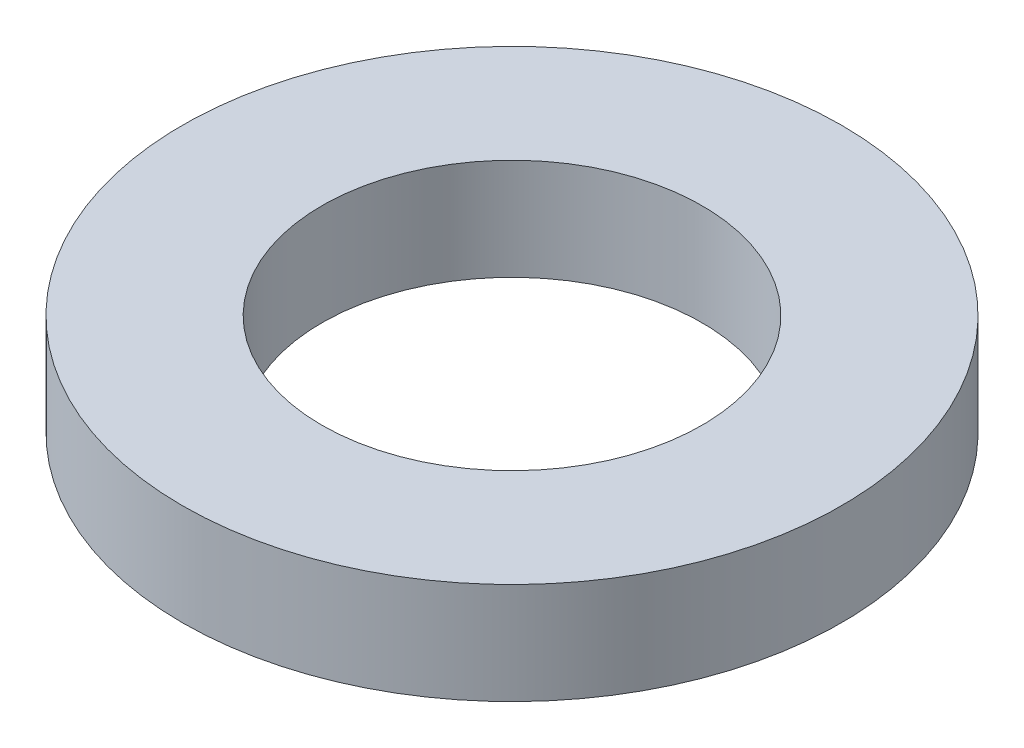
ISO-10303-21;
HEADER;
FILE_DESCRIPTION(('STEP AP214'),'2;1');
FILE_NAME('part.step','',(''),(''),'','','');
FILE_SCHEMA(('AUTOMOTIVE_DESIGN { 1 0 10303 214 1 1 1 1 }'));
ENDSEC;
DATA;
#1=APPLICATION_CONTEXT('core data for automotive mechanical design processes');
#2=APPLICATION_PROTOCOL_DEFINITION('international standard','automotive_design',2000,#1);
#3=PRODUCT_CONTEXT('',#1,'mechanical');
#4=PRODUCT('Part','Part','',(#3));
#5=PRODUCT_RELATED_PRODUCT_CATEGORY('part','',(#4));
#6=PRODUCT_DEFINITION_FORMATION('','',#4);
#7=PRODUCT_DEFINITION_CONTEXT('part definition',#1,'design');
#8=PRODUCT_DEFINITION('design','',#6,#7);
#9=PRODUCT_DEFINITION_SHAPE('','',#8);
#10=(LENGTH_UNIT() NAMED_UNIT(*) SI_UNIT(.MILLI.,.METRE.));
#11=(NAMED_UNIT(*) PLANE_ANGLE_UNIT() SI_UNIT($,.RADIAN.));
#12=(NAMED_UNIT(*) SI_UNIT($,.STERADIAN.) SOLID_ANGLE_UNIT());
#13=UNCERTAINTY_MEASURE_WITH_UNIT(LENGTH_MEASURE(1.E-05),#10,'distance_accuracy_value','');
#14=(GEOMETRIC_REPRESENTATION_CONTEXT(3) GLOBAL_UNCERTAINTY_ASSIGNED_CONTEXT((#13)) GLOBAL_UNIT_ASSIGNED_CONTEXT((#10,
#11,#12)) REPRESENTATION_CONTEXT('',''));
#15=CARTESIAN_POINT('',(0.,0.,0.));
#16=DIRECTION('',(0.,0.,1.));
#17=DIRECTION('',(1.,0.,0.));
#18=AXIS2_PLACEMENT_3D('',#15,#16,#17);
#19=CARTESIAN_POINT('',(0.,20.,0.));
#20=DIRECTION('',(0.,-1.,0.));
#21=DIRECTION('',(0.,0.,-1.));
#22=AXIS2_PLACEMENT_3D('',#19,#20,#21);
#23=CYLINDRICAL_SURFACE('',#22,65.);
#24=CARTESIAN_POINT('',(0.,20.,0.));
#25=DIRECTION('',(0.,1.,0.));
#26=DIRECTION('',(0.,0.,1.));
#27=AXIS2_PLACEMENT_3D('',#24,#25,#26);
#28=CIRCLE('',#27,65.);
#29=CARTESIAN_POINT('',(0.,20.,65.));
#30=VERTEX_POINT('',#29);
#31=EDGE_CURVE('E10',#30,#30,#28,.T.);
#32=ORIENTED_EDGE('',*,*,#31,.F.);
#33=EDGE_LOOP('',(#32));
#34=FACE_BOUND('',#33,.T.);
#35=CARTESIAN_POINT('',(0.,0.,0.));
#36=DIRECTION('',(0.,1.,0.));
#37=DIRECTION('',(0.,0.,1.));
#38=AXIS2_PLACEMENT_3D('',#35,#36,#37);
#39=CIRCLE('',#38,65.);
#40=CARTESIAN_POINT('',(0.,0.,65.));
#41=VERTEX_POINT('',#40);
#42=EDGE_CURVE('E37',#41,#41,#39,.T.);
#43=ORIENTED_EDGE('',*,*,#42,.T.);
#44=EDGE_LOOP('',(#43));
#45=FACE_BOUND('',#44,.T.);
#46=ADVANCED_FACE('F40',(#34,#45),#23,.T.);
#47=CARTESIAN_POINT('',(0.,20.,0.));
#48=DIRECTION('',(0.,1.,0.));
#49=DIRECTION('',(0.,0.,1.));
#50=AXIS2_PLACEMENT_3D('',#47,#48,#49);
#51=PLANE('',#50);
#52=CARTESIAN_POINT('',(0.,20.,0.));
#53=DIRECTION('',(0.,1.,0.));
#54=DIRECTION('',(0.,0.,1.));
#55=AXIS2_PLACEMENT_3D('',#52,#53,#54);
#56=CIRCLE('',#55,37.5);
#57=CARTESIAN_POINT('',(0.,20.,37.5));
#58=VERTEX_POINT('',#57);
#59=EDGE_CURVE('E50',#58,#58,#56,.T.);
#60=ORIENTED_EDGE('',*,*,#59,.F.);
#61=EDGE_LOOP('',(#60));
#62=FACE_BOUND('',#61,.T.);
#63=ORIENTED_EDGE('',*,*,#31,.T.);
#64=EDGE_LOOP('',(#63));
#65=FACE_BOUND('',#64,.T.);
#66=ADVANCED_FACE('F59',(#62,#65),#51,.T.);
#67=CARTESIAN_POINT('',(0.,0.,0.));
#68=DIRECTION('',(0.,1.,0.));
#69=DIRECTION('',(0.,0.,1.));
#70=AXIS2_PLACEMENT_3D('',#67,#68,#69);
#71=PLANE('',#70);
#72=CARTESIAN_POINT('',(0.,0.,0.));
#73=DIRECTION('',(0.,1.,0.));
#74=DIRECTION('',(0.,0.,1.));
#75=AXIS2_PLACEMENT_3D('',#72,#73,#74);
#76=CIRCLE('',#75,37.5);
#77=CARTESIAN_POINT('',(0.,0.,37.5));
#78=VERTEX_POINT('',#77);
#79=EDGE_CURVE('E47',#78,#78,#76,.T.);
#80=ORIENTED_EDGE('',*,*,#79,.T.);
#81=EDGE_LOOP('',(#80));
#82=FACE_BOUND('',#81,.T.);
#83=ORIENTED_EDGE('',*,*,#42,.F.);
#84=EDGE_LOOP('',(#83));
#85=FACE_BOUND('',#84,.T.);
#86=ADVANCED_FACE('F58',(#82,#85),#71,.F.);
#87=CARTESIAN_POINT('',(0.,20.,0.));
#88=DIRECTION('',(0.,-1.,0.));
#89=DIRECTION('',(0.,0.,-1.));
#90=AXIS2_PLACEMENT_3D('',#87,#88,#89);
#91=CYLINDRICAL_SURFACE('',#90,37.5);
#92=ORIENTED_EDGE('',*,*,#59,.T.);
#93=EDGE_LOOP('',(#92));
#94=FACE_BOUND('',#93,.T.);
#95=ORIENTED_EDGE('',*,*,#79,.F.);
#96=EDGE_LOOP('',(#95));
#97=FACE_BOUND('',#96,.T.);
#98=ADVANCED_FACE('F54',(#94,#97),#91,.F.);
#99=CLOSED_SHELL('',(#46,#66,#86,#98));
#100=MANIFOLD_SOLID_BREP('B2',#99);
#101=ADVANCED_BREP_SHAPE_REPRESENTATION('',(#18,#100),#14);
#102=SHAPE_DEFINITION_REPRESENTATION(#9,#101);
ENDSEC;
END-ISO-10303-21;
